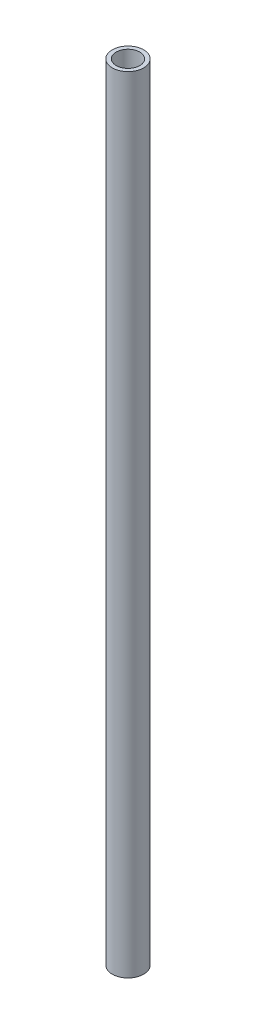
ISO-10303-21;
HEADER;
FILE_DESCRIPTION(('STEP AP214'),'2;1');
FILE_NAME('part.step','',(''),(''),'','','');
FILE_SCHEMA(('AUTOMOTIVE_DESIGN { 1 0 10303 214 1 1 1 1 }'));
ENDSEC;
DATA;
#1=APPLICATION_CONTEXT('core data for automotive mechanical design processes');
#2=APPLICATION_PROTOCOL_DEFINITION('international standard','automotive_design',2000,#1);
#3=PRODUCT_CONTEXT('',#1,'mechanical');
#4=PRODUCT('Part','Part','',(#3));
#5=PRODUCT_RELATED_PRODUCT_CATEGORY('part','',(#4));
#6=PRODUCT_DEFINITION_FORMATION('','',#4);
#7=PRODUCT_DEFINITION_CONTEXT('part definition',#1,'design');
#8=PRODUCT_DEFINITION('design','',#6,#7);
#9=PRODUCT_DEFINITION_SHAPE('','',#8);
#10=(LENGTH_UNIT() NAMED_UNIT(*) SI_UNIT(.MILLI.,.METRE.));
#11=(NAMED_UNIT(*) PLANE_ANGLE_UNIT() SI_UNIT($,.RADIAN.));
#12=(NAMED_UNIT(*) SI_UNIT($,.STERADIAN.) SOLID_ANGLE_UNIT());
#13=UNCERTAINTY_MEASURE_WITH_UNIT(LENGTH_MEASURE(1.E-05),#10,'distance_accuracy_value','');
#14=(GEOMETRIC_REPRESENTATION_CONTEXT(3) GLOBAL_UNCERTAINTY_ASSIGNED_CONTEXT((#13)) GLOBAL_UNIT_ASSIGNED_CONTEXT((#10,
#11,#12)) REPRESENTATION_CONTEXT('',''));
#15=CARTESIAN_POINT('',(0.,0.,0.));
#16=DIRECTION('',(0.,0.,1.));
#17=DIRECTION('',(1.,0.,0.));
#18=AXIS2_PLACEMENT_3D('',#15,#16,#17);
#19=CARTESIAN_POINT('',(0.,200.,0.));
#20=DIRECTION('',(0.,1.,0.));
#21=DIRECTION('',(0.,0.,1.));
#22=AXIS2_PLACEMENT_3D('',#19,#20,#21);
#23=PLANE('',#22);
#24=CARTESIAN_POINT('',(0.,200.,0.));
#25=DIRECTION('',(0.,1.,0.));
#26=DIRECTION('',(0.,0.,1.));
#27=AXIS2_PLACEMENT_3D('',#24,#25,#26);
#28=CIRCLE('',#27,4.);
#29=CARTESIAN_POINT('',(0.,200.,4.));
#30=VERTEX_POINT('',#29);
#31=EDGE_CURVE('E10',#30,#30,#28,.T.);
#32=ORIENTED_EDGE('',*,*,#31,.T.);
#33=EDGE_LOOP('',(#32));
#34=FACE_BOUND('',#33,.T.);
#35=CARTESIAN_POINT('',(0.,200.,0.));
#36=DIRECTION('',(0.,1.,0.));
#37=DIRECTION('',(0.,0.,1.));
#38=AXIS2_PLACEMENT_3D('',#35,#36,#37);
#39=CIRCLE('',#38,3.);
#40=CARTESIAN_POINT('',(0.,200.,3.));
#41=VERTEX_POINT('',#40);
#42=EDGE_CURVE('E44',#41,#41,#39,.T.);
#43=ORIENTED_EDGE('',*,*,#42,.F.);
#44=EDGE_LOOP('',(#43));
#45=FACE_BOUND('',#44,.T.);
#46=ADVANCED_FACE('F33',(#34,#45),#23,.T.);
#47=CARTESIAN_POINT('',(0.,0.,0.));
#48=DIRECTION('',(0.,1.,0.));
#49=DIRECTION('',(0.,0.,1.));
#50=AXIS2_PLACEMENT_3D('',#47,#48,#49);
#51=PLANE('',#50);
#52=CARTESIAN_POINT('',(0.,0.,0.));
#53=DIRECTION('',(0.,1.,0.));
#54=DIRECTION('',(0.,0.,1.));
#55=AXIS2_PLACEMENT_3D('',#52,#53,#54);
#56=CIRCLE('',#55,4.);
#57=CARTESIAN_POINT('',(0.,0.,4.));
#58=VERTEX_POINT('',#57);
#59=EDGE_CURVE('E37',#58,#58,#56,.T.);
#60=ORIENTED_EDGE('',*,*,#59,.F.);
#61=EDGE_LOOP('',(#60));
#62=FACE_BOUND('',#61,.T.);
#63=CARTESIAN_POINT('',(0.,0.,0.));
#64=DIRECTION('',(0.,1.,0.));
#65=DIRECTION('',(0.,0.,1.));
#66=AXIS2_PLACEMENT_3D('',#63,#64,#65);
#67=CIRCLE('',#66,3.);
#68=CARTESIAN_POINT('',(0.,0.,3.));
#69=VERTEX_POINT('',#68);
#70=EDGE_CURVE('E46',#69,#69,#67,.T.);
#71=ORIENTED_EDGE('',*,*,#70,.T.);
#72=EDGE_LOOP('',(#71));
#73=FACE_BOUND('',#72,.T.);
#74=ADVANCED_FACE('F56',(#62,#73),#51,.F.);
#75=CARTESIAN_POINT('',(0.,200.,0.));
#76=DIRECTION('',(0.,-1.,0.));
#77=DIRECTION('',(0.,0.,-1.));
#78=AXIS2_PLACEMENT_3D('',#75,#76,#77);
#79=CYLINDRICAL_SURFACE('',#78,4.);
#80=ORIENTED_EDGE('',*,*,#31,.F.);
#81=EDGE_LOOP('',(#80));
#82=FACE_BOUND('',#81,.T.);
#83=ORIENTED_EDGE('',*,*,#59,.T.);
#84=EDGE_LOOP('',(#83));
#85=FACE_BOUND('',#84,.T.);
#86=ADVANCED_FACE('F35',(#82,#85),#79,.T.);
#87=CARTESIAN_POINT('',(0.,200.,0.));
#88=DIRECTION('',(0.,-1.,0.));
#89=DIRECTION('',(0.,0.,-1.));
#90=AXIS2_PLACEMENT_3D('',#87,#88,#89);
#91=CYLINDRICAL_SURFACE('',#90,3.);
#92=ORIENTED_EDGE('',*,*,#42,.T.);
#93=EDGE_LOOP('',(#92));
#94=FACE_BOUND('',#93,.T.);
#95=ORIENTED_EDGE('',*,*,#70,.F.);
#96=EDGE_LOOP('',(#95));
#97=FACE_BOUND('',#96,.T.);
#98=ADVANCED_FACE('F52',(#94,#97),#91,.F.);
#99=CLOSED_SHELL('',(#46,#74,#86,#98));
#100=MANIFOLD_SOLID_BREP('B2',#99);
#101=ADVANCED_BREP_SHAPE_REPRESENTATION('',(#18,#100),#14);
#102=SHAPE_DEFINITION_REPRESENTATION(#9,#101);
ENDSEC;
END-ISO-10303-21;
